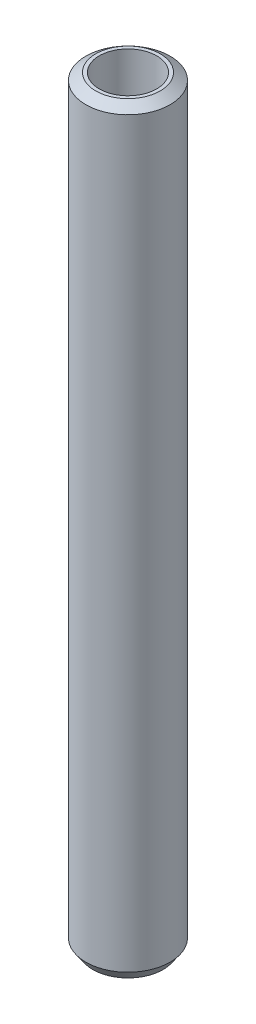
ISO-10303-21;
HEADER;
FILE_DESCRIPTION(('STEP AP214'),'2;1');
FILE_NAME('part.step','',(''),(''),'','','');
FILE_SCHEMA(('AUTOMOTIVE_DESIGN { 1 0 10303 214 1 1 1 1 }'));
ENDSEC;
DATA;
#1=APPLICATION_CONTEXT('core data for automotive mechanical design processes');
#2=APPLICATION_PROTOCOL_DEFINITION('international standard','automotive_design',2000,#1);
#3=PRODUCT_CONTEXT('',#1,'mechanical');
#4=PRODUCT('Part','Part','',(#3));
#5=PRODUCT_RELATED_PRODUCT_CATEGORY('part','',(#4));
#6=PRODUCT_DEFINITION_FORMATION('','',#4);
#7=PRODUCT_DEFINITION_CONTEXT('part definition',#1,'design');
#8=PRODUCT_DEFINITION('design','',#6,#7);
#9=PRODUCT_DEFINITION_SHAPE('','',#8);
#10=(LENGTH_UNIT() NAMED_UNIT(*) SI_UNIT(.MILLI.,.METRE.));
#11=(NAMED_UNIT(*) PLANE_ANGLE_UNIT() SI_UNIT($,.RADIAN.));
#12=(NAMED_UNIT(*) SI_UNIT($,.STERADIAN.) SOLID_ANGLE_UNIT());
#13=UNCERTAINTY_MEASURE_WITH_UNIT(LENGTH_MEASURE(1.E-05),#10,'distance_accuracy_value','');
#14=(GEOMETRIC_REPRESENTATION_CONTEXT(3) GLOBAL_UNCERTAINTY_ASSIGNED_CONTEXT((#13)) GLOBAL_UNIT_ASSIGNED_CONTEXT((#10,
#11,#12)) REPRESENTATION_CONTEXT('',''));
#15=CARTESIAN_POINT('',(0.,0.,0.));
#16=DIRECTION('',(0.,0.,1.));
#17=DIRECTION('',(1.,0.,0.));
#18=AXIS2_PLACEMENT_3D('',#15,#16,#17);
#19=CARTESIAN_POINT('',(0.,540.845389074848,0.));
#20=DIRECTION('',(0.,-1.,0.));
#21=DIRECTION('',(0.,0.,-1.));
#22=AXIS2_PLACEMENT_3D('',#19,#20,#21);
#23=CYLINDRICAL_SURFACE('',#22,30.);
#24=CARTESIAN_POINT('',(0.,535.887989474236,0.));
#25=DIRECTION('',(0.,1.,0.));
#26=DIRECTION('',(0.,0.,1.));
#27=AXIS2_PLACEMENT_3D('',#24,#25,#26);
#28=CIRCLE('',#27,30.);
#29=CARTESIAN_POINT('',(0.,535.887989474236,30.));
#30=VERTEX_POINT('',#29);
#31=EDGE_CURVE('E50',#30,#30,#28,.F.);
#32=ORIENTED_EDGE('',*,*,#31,.T.);
#33=EDGE_LOOP('',(#32));
#34=FACE_BOUND('',#33,.T.);
#35=CARTESIAN_POINT('',(0.,7.05997912093681,0.));
#36=DIRECTION('',(0.,1.,0.));
#37=DIRECTION('',(0.,0.,1.));
#38=AXIS2_PLACEMENT_3D('',#35,#36,#37);
#39=CIRCLE('',#38,30.);
#40=CARTESIAN_POINT('',(0.,7.05997912093681,30.));
#41=VERTEX_POINT('',#40);
#42=EDGE_CURVE('E51',#41,#41,#39,.T.);
#43=ORIENTED_EDGE('',*,*,#42,.T.);
#44=EDGE_LOOP('',(#43));
#45=FACE_BOUND('',#44,.T.);
#46=ADVANCED_FACE('F39',(#34,#45),#23,.T.);
#47=CARTESIAN_POINT('',(0.,540.845389074848,0.));
#48=DIRECTION('',(0.,1.,0.));
#49=DIRECTION('',(0.,0.,1.));
#50=AXIS2_PLACEMENT_3D('',#47,#48,#49);
#51=PLANE('',#50);
#52=CARTESIAN_POINT('',(0.,540.845389074848,0.));
#53=DIRECTION('',(0.,1.,0.));
#54=DIRECTION('',(0.,0.,1.));
#55=AXIS2_PLACEMENT_3D('',#52,#53,#54);
#56=CIRCLE('',#55,22.9400208790629);
#57=CARTESIAN_POINT('',(0.,540.845389074848,22.9400208790629));
#58=VERTEX_POINT('',#57);
#59=EDGE_CURVE('E54',#58,#58,#56,.T.);
#60=ORIENTED_EDGE('',*,*,#59,.T.);
#61=EDGE_LOOP('',(#60));
#62=FACE_BOUND('',#61,.T.);
#63=CARTESIAN_POINT('',(0.,540.845389074848,0.));
#64=DIRECTION('',(0.,1.,0.));
#65=DIRECTION('',(0.,0.,1.));
#66=AXIS2_PLACEMENT_3D('',#63,#64,#65);
#67=CIRCLE('',#66,20.4520851008277);
#68=CARTESIAN_POINT('',(0.,540.845389074848,20.4520851008277));
#69=VERTEX_POINT('',#68);
#70=EDGE_CURVE('E58',#69,#69,#67,.T.);
#71=ORIENTED_EDGE('',*,*,#70,.F.);
#72=EDGE_LOOP('',(#71));
#73=FACE_BOUND('',#72,.T.);
#74=ADVANCED_FACE('F69',(#62,#73),#51,.T.);
#75=CARTESIAN_POINT('',(0.,0.,0.));
#76=DIRECTION('',(0.,1.,0.));
#77=DIRECTION('',(0.,0.,1.));
#78=AXIS2_PLACEMENT_3D('',#75,#76,#77);
#79=PLANE('',#78);
#80=CARTESIAN_POINT('',(0.,0.,0.));
#81=DIRECTION('',(0.,1.,0.));
#82=DIRECTION('',(0.,0.,1.));
#83=AXIS2_PLACEMENT_3D('',#80,#81,#82);
#84=CIRCLE('',#83,25.0426003993878);
#85=CARTESIAN_POINT('',(0.,0.,25.0426003993878));
#86=VERTEX_POINT('',#85);
#87=EDGE_CURVE('E10',#86,#86,#84,.F.);
#88=ORIENTED_EDGE('',*,*,#87,.T.);
#89=EDGE_LOOP('',(#88));
#90=FACE_BOUND('',#89,.T.);
#91=CARTESIAN_POINT('',(0.,0.,0.));
#92=DIRECTION('',(0.,1.,0.));
#93=DIRECTION('',(0.,0.,1.));
#94=AXIS2_PLACEMENT_3D('',#91,#92,#93);
#95=CIRCLE('',#94,20.4520851008277);
#96=CARTESIAN_POINT('',(0.,0.,20.4520851008277));
#97=VERTEX_POINT('',#96);
#98=EDGE_CURVE('E63',#97,#97,#95,.T.);
#99=ORIENTED_EDGE('',*,*,#98,.T.);
#100=EDGE_LOOP('',(#99));
#101=FACE_BOUND('',#100,.T.);
#102=ADVANCED_FACE('F75',(#90,#101),#79,.F.);
#103=CARTESIAN_POINT('',(0.,540.845389074848,0.));
#104=DIRECTION('',(0.,-1.,0.));
#105=DIRECTION('',(0.,0.,-1.));
#106=AXIS2_PLACEMENT_3D('',#103,#104,#105);
#107=CYLINDRICAL_SURFACE('',#106,20.4520851008277);
#108=ORIENTED_EDGE('',*,*,#70,.T.);
#109=EDGE_LOOP('',(#108));
#110=FACE_BOUND('',#109,.T.);
#111=ORIENTED_EDGE('',*,*,#98,.F.);
#112=EDGE_LOOP('',(#111));
#113=FACE_BOUND('',#112,.T.);
#114=ADVANCED_FACE('F70',(#110,#113),#107,.F.);
#115=CARTESIAN_POINT('',(0.,540.845389074848,0.));
#116=DIRECTION('',(0.,-1.,0.));
#117=DIRECTION('',(0.,0.,-1.));
#118=AXIS2_PLACEMENT_3D('',#115,#116,#117);
#119=CONICAL_SURFACE('',#118,22.9400208790629,0.958606547359864);
#120=ORIENTED_EDGE('',*,*,#31,.F.);
#121=EDGE_LOOP('',(#120));
#122=FACE_BOUND('',#121,.T.);
#123=ORIENTED_EDGE('',*,*,#59,.F.);
#124=EDGE_LOOP('',(#123));
#125=FACE_BOUND('',#124,.T.);
#126=ADVANCED_FACE('F81',(#122,#125),#119,.T.);
#127=CARTESIAN_POINT('',(0.,7.05997912093681,0.));
#128=DIRECTION('',(0.,1.,0.));
#129=DIRECTION('',(0.,0.,1.));
#130=AXIS2_PLACEMENT_3D('',#127,#128,#129);
#131=CONICAL_SURFACE('',#130,30.,0.612189779435026);
#132=ORIENTED_EDGE('',*,*,#87,.F.);
#133=EDGE_LOOP('',(#132));
#134=FACE_BOUND('',#133,.T.);
#135=ORIENTED_EDGE('',*,*,#42,.F.);
#136=EDGE_LOOP('',(#135));
#137=FACE_BOUND('',#136,.T.);
#138=ADVANCED_FACE('F45',(#134,#137),#131,.T.);
#139=CLOSED_SHELL('',(#46,#74,#102,#114,#126,#138));
#140=MANIFOLD_SOLID_BREP('B2',#139);
#141=ADVANCED_BREP_SHAPE_REPRESENTATION('',(#18,#140),#14);
#142=SHAPE_DEFINITION_REPRESENTATION(#9,#141);
ENDSEC;
END-ISO-10303-21;
